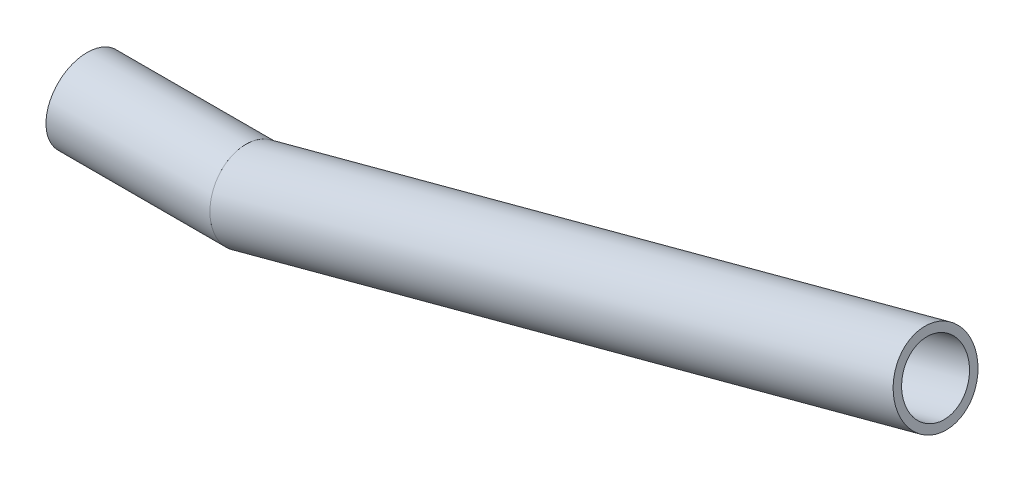
ISO-10303-21;
HEADER;
FILE_DESCRIPTION(('STEP AP214'),'2;1');
FILE_NAME('part.step','',(''),(''),'','','');
FILE_SCHEMA(('AUTOMOTIVE_DESIGN { 1 0 10303 214 1 1 1 1 }'));
ENDSEC;
DATA;
#1=APPLICATION_CONTEXT('core data for automotive mechanical design processes');
#2=APPLICATION_PROTOCOL_DEFINITION('international standard','automotive_design',2000,#1);
#3=PRODUCT_CONTEXT('',#1,'mechanical');
#4=PRODUCT('Part','Part','',(#3));
#5=PRODUCT_RELATED_PRODUCT_CATEGORY('part','',(#4));
#6=PRODUCT_DEFINITION_FORMATION('','',#4);
#7=PRODUCT_DEFINITION_CONTEXT('part definition',#1,'design');
#8=PRODUCT_DEFINITION('design','',#6,#7);
#9=PRODUCT_DEFINITION_SHAPE('','',#8);
#10=(LENGTH_UNIT() NAMED_UNIT(*) SI_UNIT(.MILLI.,.METRE.));
#11=(NAMED_UNIT(*) PLANE_ANGLE_UNIT() SI_UNIT($,.RADIAN.));
#12=(NAMED_UNIT(*) SI_UNIT($,.STERADIAN.) SOLID_ANGLE_UNIT());
#13=UNCERTAINTY_MEASURE_WITH_UNIT(LENGTH_MEASURE(1.E-05),#10,'distance_accuracy_value','');
#14=(GEOMETRIC_REPRESENTATION_CONTEXT(3) GLOBAL_UNCERTAINTY_ASSIGNED_CONTEXT((#13)) GLOBAL_UNIT_ASSIGNED_CONTEXT((#10,
#11,#12)) REPRESENTATION_CONTEXT('',''));
#15=CARTESIAN_POINT('',(0.,0.,0.));
#16=DIRECTION('',(0.,0.,1.));
#17=DIRECTION('',(1.,0.,0.));
#18=AXIS2_PLACEMENT_3D('',#15,#16,#17);
#19=CARTESIAN_POINT('',(-56.518138061836,25.8934908541217,0.));
#20=DIRECTION('',(-1.,0.,0.));
#21=DIRECTION('',(0.,0.,1.));
#22=AXIS2_PLACEMENT_3D('',#19,#20,#21);
#23=CYLINDRICAL_SURFACE('',#22,10.16);
#24=CARTESIAN_POINT('',(-107.318138061836,25.8934908541217,0.));
#25=DIRECTION('',(1.,0.,0.));
#26=DIRECTION('',(0.,0.,-1.));
#27=AXIS2_PLACEMENT_3D('',#24,#25,#26);
#28=CIRCLE('',#27,10.16);
#29=CARTESIAN_POINT('',(-107.318138061836,25.8934908541217,-10.16));
#30=VERTEX_POINT('',#29);
#31=EDGE_CURVE('E62',#30,#30,#28,.T.);
#32=ORIENTED_EDGE('',*,*,#31,.F.);
#33=EDGE_LOOP('',(#32));
#34=FACE_BOUND('',#33,.T.);
#35=CARTESIAN_POINT('',(-56.518138061836,25.8934908541217,0.));
#36=DIRECTION('',(0.99144486137381,0.130526192220052,0.));
#37=DIRECTION('',(-0.130526192220052,0.99144486137381,0.));
#38=AXIS2_PLACEMENT_3D('',#35,#36,#37);
#39=ELLIPSE('',#38,10.2476702394944,10.16);
#40=CARTESIAN_POINT('',(-57.855727437324,36.0534908541217,0.));
#41=VERTEX_POINT('',#40);
#42=EDGE_CURVE('E58',#41,#41,#39,.T.);
#43=ORIENTED_EDGE('',*,*,#42,.T.);
#44=EDGE_LOOP('',(#43));
#45=FACE_BOUND('',#44,.T.);
#46=ADVANCED_FACE('F54',(#34,#45),#23,.F.);
#47=CARTESIAN_POINT('',(-56.518138061836,25.8934908541217,0.));
#48=DIRECTION('',(-1.,0.,0.));
#49=DIRECTION('',(0.,0.,1.));
#50=AXIS2_PLACEMENT_3D('',#47,#48,#49);
#51=CYLINDRICAL_SURFACE('',#50,12.7);
#52=CARTESIAN_POINT('',(-107.318138061836,25.8934908541217,0.));
#53=DIRECTION('',(1.,0.,0.));
#54=DIRECTION('',(0.,0.,-1.));
#55=AXIS2_PLACEMENT_3D('',#52,#53,#54);
#56=CIRCLE('',#55,12.7);
#57=CARTESIAN_POINT('',(-107.318138061836,25.8934908541217,-12.7));
#58=VERTEX_POINT('',#57);
#59=EDGE_CURVE('E66',#58,#58,#56,.T.);
#60=ORIENTED_EDGE('',*,*,#59,.T.);
#61=EDGE_LOOP('',(#60));
#62=FACE_BOUND('',#61,.T.);
#63=CARTESIAN_POINT('',(-56.518138061836,25.8934908541217,0.));
#64=DIRECTION('',(0.99144486137381,0.130526192220052,0.));
#65=DIRECTION('',(-0.130526192220052,0.99144486137381,0.));
#66=AXIS2_PLACEMENT_3D('',#63,#64,#65);
#67=ELLIPSE('',#66,12.8095877993679,12.7);
#68=CARTESIAN_POINT('',(-58.190124781196,38.5934908541217,0.));
#69=VERTEX_POINT('',#68);
#70=EDGE_CURVE('E12',#69,#69,#67,.T.);
#71=ORIENTED_EDGE('',*,*,#70,.F.);
#72=EDGE_LOOP('',(#71));
#73=FACE_BOUND('',#72,.T.);
#74=ADVANCED_FACE('F81',(#62,#73),#51,.T.);
#75=CARTESIAN_POINT('',(-107.318138061836,25.8934908541217,0.));
#76=DIRECTION('',(1.,0.,0.));
#77=DIRECTION('',(0.,0.,-1.));
#78=AXIS2_PLACEMENT_3D('',#75,#76,#77);
#79=PLANE('',#78);
#80=ORIENTED_EDGE('',*,*,#31,.T.);
#81=EDGE_LOOP('',(#80));
#82=FACE_BOUND('',#81,.T.);
#83=ORIENTED_EDGE('',*,*,#59,.F.);
#84=EDGE_LOOP('',(#83));
#85=FACE_BOUND('',#84,.T.);
#86=ADVANCED_FACE('F77',(#82,#85),#79,.F.);
#87=CARTESIAN_POINT('',(-56.518138061836,25.8934908541217,0.));
#88=DIRECTION('',(0.99144486137381,0.130526192220052,0.));
#89=DIRECTION('',(-0.130526192220052,0.99144486137381,0.));
#90=AXIS2_PLACEMENT_3D('',#87,#88,#89);
#91=PLANE('',#90);
#92=ORIENTED_EDGE('',*,*,#42,.F.);
#93=EDGE_LOOP('',(#92));
#94=FACE_BOUND('',#93,.T.);
#95=ORIENTED_EDGE('',*,*,#70,.T.);
#96=EDGE_LOOP('',(#95));
#97=FACE_BOUND('',#96,.T.);
#98=ADVANCED_FACE('F56',(#94,#97),#91,.T.);
#99=CLOSED_SHELL('',(#46,#74,#86,#98));
#100=MANIFOLD_SOLID_BREP('B2',#99);
#101=CARTESIAN_POINT('',(154.969389752503,82.5614031412288,0.));
#102=DIRECTION('',(-0.965925826289068,-0.258819045102522,0.));
#103=DIRECTION('',(0.258819045102522,-0.965925826289068,0.));
#104=AXIS2_PLACEMENT_3D('',#101,#102,#103);
#105=CYLINDRICAL_SURFACE('',#104,10.16);
#106=CARTESIAN_POINT('',(154.969389752503,82.5614031412288,0.));
#107=DIRECTION('',(0.965925826289068,0.258819045102522,0.));
#108=DIRECTION('',(0.,0.,-1.));
#109=AXIS2_PLACEMENT_3D('',#106,#107,#108);
#110=CIRCLE('',#109,10.16);
#111=CARTESIAN_POINT('',(154.969389752503,82.5614031412288,-10.16));
#112=VERTEX_POINT('',#111);
#113=EDGE_CURVE('E156',#112,#112,#110,.T.);
#114=ORIENTED_EDGE('',*,*,#113,.T.);
#115=EDGE_LOOP('',(#114));
#116=FACE_BOUND('',#115,.T.);
#117=CARTESIAN_POINT('',(-56.518138061836,25.8934908541217,0.));
#118=DIRECTION('',(-0.99144486137381,-0.130526192220052,0.));
#119=DIRECTION('',(0.130526192220052,-0.99144486137381,0.));
#120=AXIS2_PLACEMENT_3D('',#117,#118,#119);
#121=ELLIPSE('',#120,10.2476702394944,10.16);
#122=CARTESIAN_POINT('',(-55.1805486863481,15.7334908541217,0.));
#123=VERTEX_POINT('',#122);
#124=EDGE_CURVE('E146',#123,#123,#121,.T.);
#125=ORIENTED_EDGE('',*,*,#124,.T.);
#126=EDGE_LOOP('',(#125));
#127=FACE_BOUND('',#126,.T.);
#128=ADVANCED_FACE('F142',(#116,#127),#105,.F.);
#129=CARTESIAN_POINT('',(154.969389752503,82.5614031412288,0.));
#130=DIRECTION('',(-0.965925826289068,-0.258819045102522,0.));
#131=DIRECTION('',(0.258819045102522,-0.965925826289068,0.));
#132=AXIS2_PLACEMENT_3D('',#129,#130,#131);
#133=CYLINDRICAL_SURFACE('',#132,12.7);
#134=CARTESIAN_POINT('',(154.969389752503,82.5614031412288,0.));
#135=DIRECTION('',(0.965925826289068,0.258819045102522,0.));
#136=DIRECTION('',(0.,0.,-1.));
#137=AXIS2_PLACEMENT_3D('',#134,#135,#136);
#138=CIRCLE('',#137,12.7);
#139=CARTESIAN_POINT('',(154.969389752503,82.5614031412288,-12.7));
#140=VERTEX_POINT('',#139);
#141=EDGE_CURVE('E150',#140,#140,#138,.T.);
#142=ORIENTED_EDGE('',*,*,#141,.F.);
#143=EDGE_LOOP('',(#142));
#144=FACE_BOUND('',#143,.T.);
#145=CARTESIAN_POINT('',(-56.518138061836,25.8934908541217,0.));
#146=DIRECTION('',(-0.99144486137381,-0.130526192220052,0.));
#147=DIRECTION('',(0.130526192220052,-0.99144486137381,0.));
#148=AXIS2_PLACEMENT_3D('',#145,#146,#147);
#149=ELLIPSE('',#148,12.8095877993679,12.7);
#150=CARTESIAN_POINT('',(-54.8461513424761,13.1934908541217,0.));
#151=VERTEX_POINT('',#150);
#152=EDGE_CURVE('E53',#151,#151,#149,.T.);
#153=ORIENTED_EDGE('',*,*,#152,.F.);
#154=EDGE_LOOP('',(#153));
#155=FACE_BOUND('',#154,.T.);
#156=ADVANCED_FACE('F169',(#144,#155),#133,.T.);
#157=CARTESIAN_POINT('',(154.969389752503,82.5614031412288,0.));
#158=DIRECTION('',(0.965925826289068,0.258819045102522,0.));
#159=DIRECTION('',(0.,0.,-1.));
#160=AXIS2_PLACEMENT_3D('',#157,#158,#159);
#161=PLANE('',#160);
#162=ORIENTED_EDGE('',*,*,#113,.F.);
#163=EDGE_LOOP('',(#162));
#164=FACE_BOUND('',#163,.T.);
#165=ORIENTED_EDGE('',*,*,#141,.T.);
#166=EDGE_LOOP('',(#165));
#167=FACE_BOUND('',#166,.T.);
#168=ADVANCED_FACE('F165',(#164,#167),#161,.T.);
#169=CARTESIAN_POINT('',(-56.518138061836,25.8934908541217,0.));
#170=DIRECTION('',(-0.99144486137381,-0.130526192220052,0.));
#171=DIRECTION('',(0.130526192220052,-0.99144486137381,0.));
#172=AXIS2_PLACEMENT_3D('',#169,#170,#171);
#173=PLANE('',#172);
#174=ORIENTED_EDGE('',*,*,#124,.F.);
#175=EDGE_LOOP('',(#174));
#176=FACE_BOUND('',#175,.T.);
#177=ORIENTED_EDGE('',*,*,#152,.T.);
#178=EDGE_LOOP('',(#177));
#179=FACE_BOUND('',#178,.T.);
#180=ADVANCED_FACE('F144',(#176,#179),#173,.T.);
#181=CLOSED_SHELL('',(#128,#156,#168,#180));
#182=MANIFOLD_SOLID_BREP('B7',#181);
#183=ADVANCED_BREP_SHAPE_REPRESENTATION('',(#18,#100,#182),#14);
#184=SHAPE_DEFINITION_REPRESENTATION(#9,#183);
ENDSEC;
END-ISO-10303-21;
